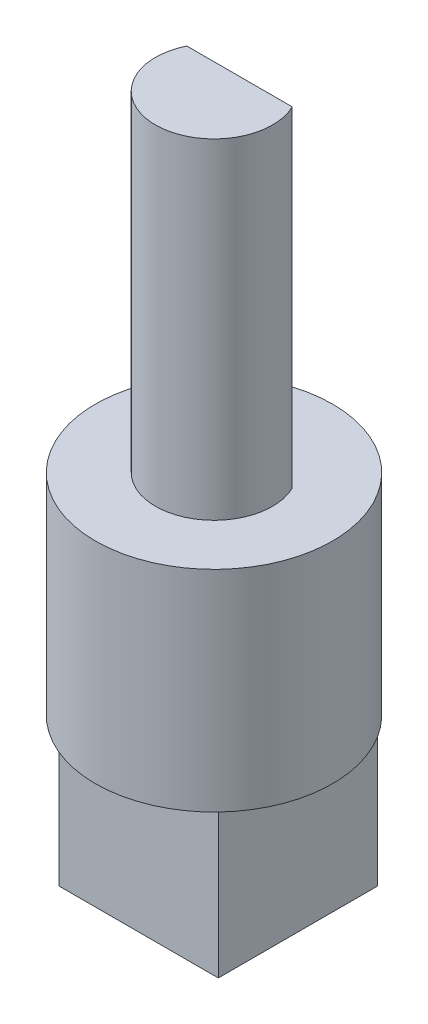
ISO-10303-21;
HEADER;
FILE_DESCRIPTION(('STEP AP214'),'2;1');
FILE_NAME('part.step','',(''),(''),'','','');
FILE_SCHEMA(('AUTOMOTIVE_DESIGN { 1 0 10303 214 1 1 1 1 }'));
ENDSEC;
DATA;
#1=APPLICATION_CONTEXT('core data for automotive mechanical design processes');
#2=APPLICATION_PROTOCOL_DEFINITION('international standard','automotive_design',2000,#1);
#3=PRODUCT_CONTEXT('',#1,'mechanical');
#4=PRODUCT('Part','Part','',(#3));
#5=PRODUCT_RELATED_PRODUCT_CATEGORY('part','',(#4));
#6=PRODUCT_DEFINITION_FORMATION('','',#4);
#7=PRODUCT_DEFINITION_CONTEXT('part definition',#1,'design');
#8=PRODUCT_DEFINITION('design','',#6,#7);
#9=PRODUCT_DEFINITION_SHAPE('','',#8);
#10=(LENGTH_UNIT() NAMED_UNIT(*) SI_UNIT(.MILLI.,.METRE.));
#11=(NAMED_UNIT(*) PLANE_ANGLE_UNIT() SI_UNIT($,.RADIAN.));
#12=(NAMED_UNIT(*) SI_UNIT($,.STERADIAN.) SOLID_ANGLE_UNIT());
#13=UNCERTAINTY_MEASURE_WITH_UNIT(LENGTH_MEASURE(1.E-05),#10,'distance_accuracy_value','');
#14=(GEOMETRIC_REPRESENTATION_CONTEXT(3) GLOBAL_UNCERTAINTY_ASSIGNED_CONTEXT((#13)) GLOBAL_UNIT_ASSIGNED_CONTEXT((#10,
#11,#12)) REPRESENTATION_CONTEXT('',''));
#15=CARTESIAN_POINT('',(0.,0.,0.));
#16=DIRECTION('',(0.,0.,1.));
#17=DIRECTION('',(1.,0.,0.));
#18=AXIS2_PLACEMENT_3D('',#15,#16,#17);
#19=CARTESIAN_POINT('',(-2.65,5.,2.50692821431314));
#20=DIRECTION('',(1.,0.,0.));
#21=DIRECTION('',(0.,0.,-1.));
#22=AXIS2_PLACEMENT_3D('',#19,#20,#21);
#23=PLANE('',#22);
#24=DIRECTION('',(0.,0.,1.));
#25=VECTOR('',#24,1.);
#26=CARTESIAN_POINT('',(-2.65,0.,2.50692821431314));
#27=LINE('',#26,#25);
#28=CARTESIAN_POINT('',(-2.65,0.,-2.79307178568686));
#29=VERTEX_POINT('',#28);
#30=CARTESIAN_POINT('',(-2.65,0.,2.50692821431314));
#31=VERTEX_POINT('',#30);
#32=EDGE_CURVE('E118',#29,#31,#27,.T.);
#33=ORIENTED_EDGE('',*,*,#32,.T.);
#34=DIRECTION('',(0.,-1.,0.));
#35=VECTOR('',#34,1.);
#36=CARTESIAN_POINT('',(-2.65,5.,2.50692821431314));
#37=LINE('',#36,#35);
#38=CARTESIAN_POINT('',(-2.65,5.,2.50692821431314));
#39=VERTEX_POINT('',#38);
#40=EDGE_CURVE('E36',#39,#31,#37,.T.);
#41=ORIENTED_EDGE('',*,*,#40,.F.);
#42=DIRECTION('',(0.,0.,1.));
#43=VECTOR('',#42,1.);
#44=CARTESIAN_POINT('',(-2.65,5.,2.50692821431314));
#45=LINE('',#44,#43);
#46=CARTESIAN_POINT('',(-2.65,5.,-2.79307178568686));
#47=VERTEX_POINT('',#46);
#48=EDGE_CURVE('E128',#47,#39,#45,.T.);
#49=ORIENTED_EDGE('',*,*,#48,.F.);
#50=DIRECTION('',(0.,-1.,0.));
#51=VECTOR('',#50,1.);
#52=CARTESIAN_POINT('',(-2.65,5.,-2.79307178568686));
#53=LINE('',#52,#51);
#54=EDGE_CURVE('E137',#47,#29,#53,.T.);
#55=ORIENTED_EDGE('',*,*,#54,.T.);
#56=EDGE_LOOP('',(#33,#41,#49,#55));
#57=FACE_BOUND('',#56,.T.);
#58=ADVANCED_FACE('F33',(#57),#23,.F.);
#59=CARTESIAN_POINT('',(2.65,5.,2.50692821431314));
#60=DIRECTION('',(0.,0.,-1.));
#61=DIRECTION('',(-1.,0.,0.));
#62=AXIS2_PLACEMENT_3D('',#59,#60,#61);
#63=PLANE('',#62);
#64=DIRECTION('',(1.,0.,0.));
#65=VECTOR('',#64,1.);
#66=CARTESIAN_POINT('',(2.65,0.,2.50692821431314));
#67=LINE('',#66,#65);
#68=CARTESIAN_POINT('',(2.65,0.,2.50692821431314));
#69=VERTEX_POINT('',#68);
#70=EDGE_CURVE('E122',#31,#69,#67,.T.);
#71=ORIENTED_EDGE('',*,*,#70,.T.);
#72=DIRECTION('',(0.,-1.,0.));
#73=VECTOR('',#72,1.);
#74=CARTESIAN_POINT('',(2.65,5.,2.50692821431314));
#75=LINE('',#74,#73);
#76=CARTESIAN_POINT('',(2.65,5.,2.50692821431314));
#77=VERTEX_POINT('',#76);
#78=EDGE_CURVE('E144',#77,#69,#75,.T.);
#79=ORIENTED_EDGE('',*,*,#78,.F.);
#80=DIRECTION('',(1.,0.,0.));
#81=VECTOR('',#80,1.);
#82=CARTESIAN_POINT('',(2.65,5.,2.50692821431314));
#83=LINE('',#82,#81);
#84=EDGE_CURVE('E83',#39,#77,#83,.T.);
#85=ORIENTED_EDGE('',*,*,#84,.F.);
#86=ORIENTED_EDGE('',*,*,#40,.T.);
#87=EDGE_LOOP('',(#71,#79,#85,#86));
#88=FACE_BOUND('',#87,.T.);
#89=ADVANCED_FACE('F147',(#88),#63,.F.);
#90=CARTESIAN_POINT('',(2.65,5.,2.50692821431314));
#91=DIRECTION('',(-1.,0.,0.));
#92=DIRECTION('',(0.,0.,1.));
#93=AXIS2_PLACEMENT_3D('',#90,#91,#92);
#94=PLANE('',#93);
#95=DIRECTION('',(0.,0.,-1.));
#96=VECTOR('',#95,1.);
#97=CARTESIAN_POINT('',(2.65,0.,2.50692821431314));
#98=LINE('',#97,#96);
#99=CARTESIAN_POINT('',(2.65,0.,-2.79307178568686));
#100=VERTEX_POINT('',#99);
#101=EDGE_CURVE('E140',#69,#100,#98,.T.);
#102=ORIENTED_EDGE('',*,*,#101,.T.);
#103=DIRECTION('',(0.,-1.,0.));
#104=VECTOR('',#103,1.);
#105=CARTESIAN_POINT('',(2.65,5.,-2.79307178568686));
#106=LINE('',#105,#104);
#107=CARTESIAN_POINT('',(2.65,5.,-2.79307178568686));
#108=VERTEX_POINT('',#107);
#109=EDGE_CURVE('E57',#108,#100,#106,.T.);
#110=ORIENTED_EDGE('',*,*,#109,.F.);
#111=DIRECTION('',(0.,0.,-1.));
#112=VECTOR('',#111,1.);
#113=CARTESIAN_POINT('',(2.65,5.,2.50692821431314));
#114=LINE('',#113,#112);
#115=EDGE_CURVE('E132',#77,#108,#114,.T.);
#116=ORIENTED_EDGE('',*,*,#115,.F.);
#117=ORIENTED_EDGE('',*,*,#78,.T.);
#118=EDGE_LOOP('',(#102,#110,#116,#117));
#119=FACE_BOUND('',#118,.T.);
#120=ADVANCED_FACE('F152',(#119),#94,.F.);
#121=CARTESIAN_POINT('',(2.65,5.,-2.79307178568686));
#122=DIRECTION('',(0.,0.,1.));
#123=DIRECTION('',(1.,0.,0.));
#124=AXIS2_PLACEMENT_3D('',#121,#122,#123);
#125=PLANE('',#124);
#126=DIRECTION('',(-1.,0.,0.));
#127=VECTOR('',#126,1.);
#128=CARTESIAN_POINT('',(2.65,0.,-2.79307178568686));
#129=LINE('',#128,#127);
#130=EDGE_CURVE('E77',#100,#29,#129,.T.);
#131=ORIENTED_EDGE('',*,*,#130,.T.);
#132=ORIENTED_EDGE('',*,*,#54,.F.);
#133=DIRECTION('',(-1.,0.,0.));
#134=VECTOR('',#133,1.);
#135=CARTESIAN_POINT('',(2.65,5.,-2.79307178568686));
#136=LINE('',#135,#134);
#137=EDGE_CURVE('E135',#108,#47,#136,.T.);
#138=ORIENTED_EDGE('',*,*,#137,.F.);
#139=ORIENTED_EDGE('',*,*,#109,.T.);
#140=EDGE_LOOP('',(#131,#132,#138,#139));
#141=FACE_BOUND('',#140,.T.);
#142=ADVANCED_FACE('F153',(#141),#125,.F.);
#143=CARTESIAN_POINT('',(0.,0.,0.));
#144=DIRECTION('',(0.,1.,0.));
#145=DIRECTION('',(0.,0.,1.));
#146=AXIS2_PLACEMENT_3D('',#143,#144,#145);
#147=PLANE('',#146);
#148=ORIENTED_EDGE('',*,*,#32,.F.);
#149=ORIENTED_EDGE('',*,*,#130,.F.);
#150=ORIENTED_EDGE('',*,*,#101,.F.);
#151=ORIENTED_EDGE('',*,*,#70,.F.);
#152=EDGE_LOOP('',(#148,#149,#150,#151));
#153=FACE_BOUND('',#152,.T.);
#154=ADVANCED_FACE('F151',(#153),#147,.F.);
#155=CARTESIAN_POINT('',(0.,5.,0.));
#156=DIRECTION('',(0.,1.,0.));
#157=DIRECTION('',(0.,0.,1.));
#158=AXIS2_PLACEMENT_3D('',#155,#156,#157);
#159=PLANE('',#158);
#160=CARTESIAN_POINT('',(0.,5.,0.));
#161=DIRECTION('',(0.,1.,0.));
#162=DIRECTION('',(0.,0.,1.));
#163=AXIS2_PLACEMENT_3D('',#160,#161,#162);
#164=CIRCLE('',#163,3.95);
#165=CARTESIAN_POINT('',(0.,5.,3.95));
#166=VERTEX_POINT('',#165);
#167=EDGE_CURVE('E119',#166,#166,#164,.T.);
#168=ORIENTED_EDGE('',*,*,#167,.F.);
#169=EDGE_LOOP('',(#168));
#170=FACE_BOUND('',#169,.T.);
#171=ORIENTED_EDGE('',*,*,#137,.T.);
#172=ORIENTED_EDGE('',*,*,#48,.T.);
#173=ORIENTED_EDGE('',*,*,#84,.T.);
#174=ORIENTED_EDGE('',*,*,#115,.T.);
#175=EDGE_LOOP('',(#171,#172,#173,#174));
#176=FACE_BOUND('',#175,.T.);
#177=ADVANCED_FACE('F155',(#170,#176),#159,.F.);
#178=CARTESIAN_POINT('',(0.,12.,0.));
#179=DIRECTION('',(0.,-1.,0.));
#180=DIRECTION('',(0.,0.,-1.));
#181=AXIS2_PLACEMENT_3D('',#178,#179,#180);
#182=CYLINDRICAL_SURFACE('',#181,3.95);
#183=CARTESIAN_POINT('',(0.,12.,0.));
#184=DIRECTION('',(0.,1.,0.));
#185=DIRECTION('',(0.,0.,1.));
#186=AXIS2_PLACEMENT_3D('',#183,#184,#185);
#187=CIRCLE('',#186,3.95);
#188=CARTESIAN_POINT('',(0.,12.,3.95));
#189=VERTEX_POINT('',#188);
#190=EDGE_CURVE('E116',#189,#189,#187,.T.);
#191=ORIENTED_EDGE('',*,*,#190,.F.);
#192=EDGE_LOOP('',(#191));
#193=FACE_BOUND('',#192,.T.);
#194=ORIENTED_EDGE('',*,*,#167,.T.);
#195=EDGE_LOOP('',(#194));
#196=FACE_BOUND('',#195,.T.);
#197=ADVANCED_FACE('F112',(#193,#196),#182,.T.);
#198=CARTESIAN_POINT('',(0.,12.,0.));
#199=DIRECTION('',(0.,1.,0.));
#200=DIRECTION('',(0.,0.,1.));
#201=AXIS2_PLACEMENT_3D('',#198,#199,#200);
#202=PLANE('',#201);
#203=CARTESIAN_POINT('',(0.,12.,0.));
#204=DIRECTION('',(0.,1.,0.));
#205=DIRECTION('',(0.,0.,1.));
#206=AXIS2_PLACEMENT_3D('',#203,#204,#205);
#207=CIRCLE('',#206,1.95);
#208=CARTESIAN_POINT('',(-1.75499287747842,12.,-0.85));
#209=VERTEX_POINT('',#208);
#210=CARTESIAN_POINT('',(1.75499287747842,12.,-0.85));
#211=VERTEX_POINT('',#210);
#212=EDGE_CURVE('E11',#209,#211,#207,.T.);
#213=ORIENTED_EDGE('',*,*,#212,.F.);
#214=DIRECTION('',(1.,0.,0.));
#215=VECTOR('',#214,1.);
#216=CARTESIAN_POINT('',(-1.75499287747842,12.,-0.85));
#217=LINE('',#216,#215);
#218=EDGE_CURVE('E95',#209,#211,#217,.T.);
#219=ORIENTED_EDGE('',*,*,#218,.T.);
#220=EDGE_LOOP('',(#213,#219));
#221=FACE_BOUND('',#220,.T.);
#222=ORIENTED_EDGE('',*,*,#190,.T.);
#223=EDGE_LOOP('',(#222));
#224=FACE_BOUND('',#223,.T.);
#225=ADVANCED_FACE('F109',(#221,#224),#202,.T.);
#226=CARTESIAN_POINT('',(0.,23.,0.));
#227=DIRECTION('',(0.,-1.,0.));
#228=DIRECTION('',(0.,0.,-1.));
#229=AXIS2_PLACEMENT_3D('',#226,#227,#228);
#230=CYLINDRICAL_SURFACE('',#229,1.95);
#231=CARTESIAN_POINT('',(0.,23.,0.));
#232=DIRECTION('',(0.,1.,0.));
#233=DIRECTION('',(0.,0.,1.));
#234=AXIS2_PLACEMENT_3D('',#231,#232,#233);
#235=CIRCLE('',#234,1.95);
#236=CARTESIAN_POINT('',(-1.75499287747842,23.,-0.85));
#237=VERTEX_POINT('',#236);
#238=CARTESIAN_POINT('',(1.75499287747842,23.,-0.85));
#239=VERTEX_POINT('',#238);
#240=EDGE_CURVE('E107',#237,#239,#235,.T.);
#241=ORIENTED_EDGE('',*,*,#240,.F.);
#242=DIRECTION('',(0.,1.,0.));
#243=VECTOR('',#242,1.);
#244=CARTESIAN_POINT('',(-1.75499287747842,12.,-0.85));
#245=LINE('',#244,#243);
#246=EDGE_CURVE('E48',#209,#237,#245,.T.);
#247=ORIENTED_EDGE('',*,*,#246,.F.);
#248=ORIENTED_EDGE('',*,*,#212,.T.);
#249=DIRECTION('',(0.,1.,0.));
#250=VECTOR('',#249,1.);
#251=CARTESIAN_POINT('',(1.75499287747842,12.,-0.85));
#252=LINE('',#251,#250);
#253=EDGE_CURVE('E98',#211,#239,#252,.T.);
#254=ORIENTED_EDGE('',*,*,#253,.T.);
#255=EDGE_LOOP('',(#241,#247,#248,#254));
#256=FACE_BOUND('',#255,.T.);
#257=ADVANCED_FACE('F105',(#256),#230,.T.);
#258=CARTESIAN_POINT('',(0.,23.,0.));
#259=DIRECTION('',(0.,1.,0.));
#260=DIRECTION('',(0.,0.,1.));
#261=AXIS2_PLACEMENT_3D('',#258,#259,#260);
#262=PLANE('',#261);
#263=DIRECTION('',(1.,0.,0.));
#264=VECTOR('',#263,1.);
#265=CARTESIAN_POINT('',(-1.75499287747842,23.,-0.85));
#266=LINE('',#265,#264);
#267=EDGE_CURVE('E101',#237,#239,#266,.T.);
#268=ORIENTED_EDGE('',*,*,#267,.F.);
#269=ORIENTED_EDGE('',*,*,#240,.T.);
#270=EDGE_LOOP('',(#268,#269));
#271=FACE_BOUND('',#270,.T.);
#272=ADVANCED_FACE('F225',(#271),#262,.T.);
#273=CARTESIAN_POINT('',(-1.75499287747842,12.,-0.85));
#274=DIRECTION('',(0.,0.,1.));
#275=DIRECTION('',(1.,0.,0.));
#276=AXIS2_PLACEMENT_3D('',#273,#274,#275);
#277=PLANE('',#276);
#278=ORIENTED_EDGE('',*,*,#267,.T.);
#279=ORIENTED_EDGE('',*,*,#253,.F.);
#280=ORIENTED_EDGE('',*,*,#218,.F.);
#281=ORIENTED_EDGE('',*,*,#246,.T.);
#282=EDGE_LOOP('',(#278,#279,#280,#281));
#283=FACE_BOUND('',#282,.T.);
#284=ADVANCED_FACE('F96',(#283),#277,.F.);
#285=CLOSED_SHELL('',(#58,#89,#120,#142,#154,#177,#197,#225,#257,#272,#284));
#286=MANIFOLD_SOLID_BREP('B2',#285);
#287=ADVANCED_BREP_SHAPE_REPRESENTATION('',(#18,#286),#14);
#288=SHAPE_DEFINITION_REPRESENTATION(#9,#287);
ENDSEC;
END-ISO-10303-21;
